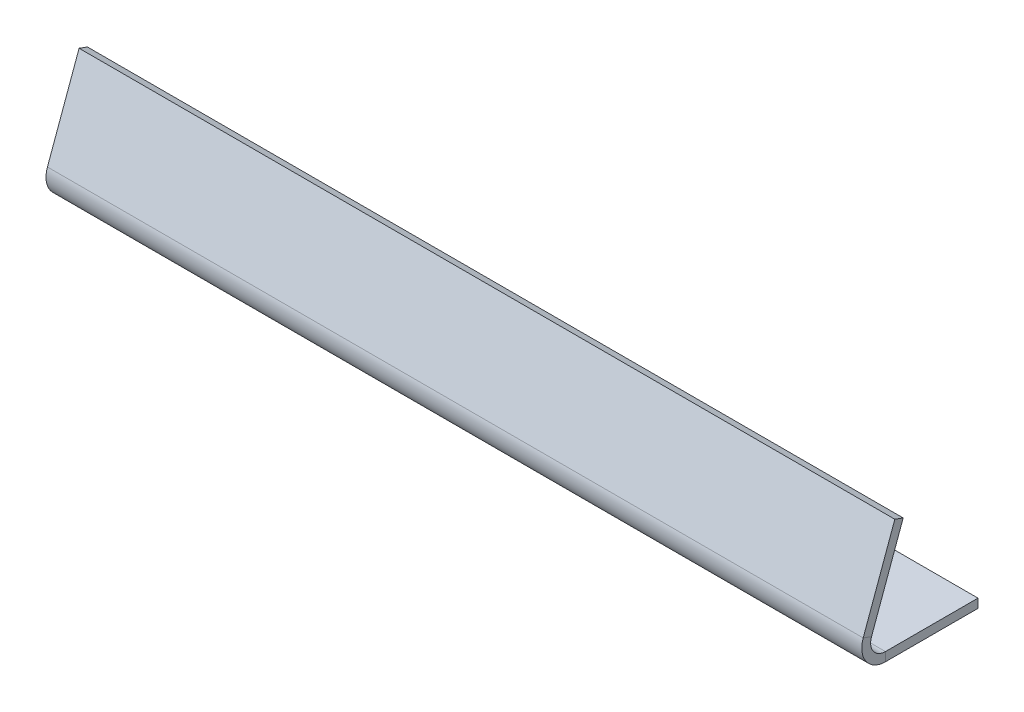
ISO-10303-21;
HEADER;
FILE_DESCRIPTION(('STEP AP214'),'2;1');
FILE_NAME('part.step','',(''),(''),'','','');
FILE_SCHEMA(('AUTOMOTIVE_DESIGN { 1 0 10303 214 1 1 1 1 }'));
ENDSEC;
DATA;
#1=APPLICATION_CONTEXT('core data for automotive mechanical design processes');
#2=APPLICATION_PROTOCOL_DEFINITION('international standard','automotive_design',2000,#1);
#3=PRODUCT_CONTEXT('',#1,'mechanical');
#4=PRODUCT('Part','Part','',(#3));
#5=PRODUCT_RELATED_PRODUCT_CATEGORY('part','',(#4));
#6=PRODUCT_DEFINITION_FORMATION('','',#4);
#7=PRODUCT_DEFINITION_CONTEXT('part definition',#1,'design');
#8=PRODUCT_DEFINITION('design','',#6,#7);
#9=PRODUCT_DEFINITION_SHAPE('','',#8);
#10=(LENGTH_UNIT() NAMED_UNIT(*) SI_UNIT(.MILLI.,.METRE.));
#11=(NAMED_UNIT(*) PLANE_ANGLE_UNIT() SI_UNIT($,.RADIAN.));
#12=(NAMED_UNIT(*) SI_UNIT($,.STERADIAN.) SOLID_ANGLE_UNIT());
#13=UNCERTAINTY_MEASURE_WITH_UNIT(LENGTH_MEASURE(1.E-05),#10,'distance_accuracy_value','');
#14=(GEOMETRIC_REPRESENTATION_CONTEXT(3) GLOBAL_UNCERTAINTY_ASSIGNED_CONTEXT((#13)) GLOBAL_UNIT_ASSIGNED_CONTEXT((#10,
#11,#12)) REPRESENTATION_CONTEXT('',''));
#15=CARTESIAN_POINT('',(0.,0.,0.));
#16=DIRECTION('',(0.,0.,1.));
#17=DIRECTION('',(1.,0.,0.));
#18=AXIS2_PLACEMENT_3D('',#15,#16,#17);
#19=CARTESIAN_POINT('',(27.55,7.42227467667266,-1.88274279780496));
#20=DIRECTION('',(1.,0.,0.));
#21=DIRECTION('',(0.,-0.939692620785907,0.342020143325673));
#22=AXIS2_PLACEMENT_3D('',#19,#20,#21);
#23=PLANE('',#22);
#24=DIRECTION('',(0.,-0.939692620785907,0.342020143325673));
#25=VECTOR('',#24,1.);
#26=CARTESIAN_POINT('',(27.55,7.42227467667266,-1.88274279780496));
#27=LINE('',#26,#25);
#28=CARTESIAN_POINT('',(27.55,7.42227467667266,-1.88274279780496));
#29=VERTEX_POINT('',#28);
#30=CARTESIAN_POINT('',(27.55,1.54723222932108,0.255597778081503));
#31=VERTEX_POINT('',#30);
#32=EDGE_CURVE('E99',#29,#31,#27,.T.);
#33=ORIENTED_EDGE('',*,*,#32,.T.);
#34=DIRECTION('',(0.,-0.342020143325673,-0.939692620785907));
#35=VECTOR('',#34,1.);
#36=CARTESIAN_POINT('',(27.55,1.54723222932108,0.255597778081503));
#37=LINE('',#36,#35);
#38=CARTESIAN_POINT('',(27.55,1.34202014332567,-0.308217794390042));
#39=VERTEX_POINT('',#38);
#40=EDGE_CURVE('E12',#31,#39,#37,.T.);
#41=ORIENTED_EDGE('',*,*,#40,.T.);
#42=DIRECTION('',(0.,-0.939692620785907,0.342020143325673));
#43=VECTOR('',#42,1.);
#44=CARTESIAN_POINT('',(27.55,7.21706259067726,-2.44655837027651));
#45=LINE('',#44,#43);
#46=CARTESIAN_POINT('',(27.55,7.21706259067726,-2.44655837027651));
#47=VERTEX_POINT('',#46);
#48=EDGE_CURVE('E89',#47,#39,#45,.T.);
#49=ORIENTED_EDGE('',*,*,#48,.F.);
#50=DIRECTION('',(0.,-0.342020143325673,-0.939692620785907));
#51=VECTOR('',#50,1.);
#52=CARTESIAN_POINT('',(27.55,7.42227467667266,-1.88274279780496));
#53=LINE('',#52,#51);
#54=EDGE_CURVE('E66',#29,#47,#53,.T.);
#55=ORIENTED_EDGE('',*,*,#54,.F.);
#56=EDGE_LOOP('',(#33,#41,#49,#55));
#57=FACE_BOUND('',#56,.T.);
#58=ADVANCED_FACE('F41',(#57),#23,.T.);
#59=CARTESIAN_POINT('',(-27.55,7.42227467667266,-1.88274279780496));
#60=DIRECTION('',(-1.,0.,0.));
#61=DIRECTION('',(0.,0.939692620785907,-0.342020143325673));
#62=AXIS2_PLACEMENT_3D('',#59,#60,#61);
#63=PLANE('',#62);
#64=DIRECTION('',(0.,0.939692620785907,-0.342020143325673));
#65=VECTOR('',#64,1.);
#66=CARTESIAN_POINT('',(-27.55,7.21706259067726,-2.44655837027651));
#67=LINE('',#66,#65);
#68=CARTESIAN_POINT('',(-27.55,1.34202014332567,-0.308217794390042));
#69=VERTEX_POINT('',#68);
#70=CARTESIAN_POINT('',(-27.55,7.21706259067726,-2.44655837027651));
#71=VERTEX_POINT('',#70);
#72=EDGE_CURVE('E93',#69,#71,#67,.T.);
#73=ORIENTED_EDGE('',*,*,#72,.F.);
#74=DIRECTION('',(0.,0.342020143325673,0.939692620785907));
#75=VECTOR('',#74,1.);
#76=CARTESIAN_POINT('',(-27.55,1.54723222932108,0.255597778081503));
#77=LINE('',#76,#75);
#78=CARTESIAN_POINT('',(-27.55,1.54723222932108,0.255597778081502));
#79=VERTEX_POINT('',#78);
#80=EDGE_CURVE('E108',#69,#79,#77,.T.);
#81=ORIENTED_EDGE('',*,*,#80,.T.);
#82=DIRECTION('',(0.,0.939692620785907,-0.342020143325673));
#83=VECTOR('',#82,1.);
#84=CARTESIAN_POINT('',(-27.55,7.42227467667266,-1.88274279780496));
#85=LINE('',#84,#83);
#86=CARTESIAN_POINT('',(-27.55,7.42227467667266,-1.88274279780496));
#87=VERTEX_POINT('',#86);
#88=EDGE_CURVE('E44',#79,#87,#85,.T.);
#89=ORIENTED_EDGE('',*,*,#88,.T.);
#90=DIRECTION('',(0.,-0.342020143325673,-0.939692620785907));
#91=VECTOR('',#90,1.);
#92=CARTESIAN_POINT('',(-27.55,7.42227467667266,-1.88274279780496));
#93=LINE('',#92,#91);
#94=EDGE_CURVE('E86',#87,#71,#93,.T.);
#95=ORIENTED_EDGE('',*,*,#94,.T.);
#96=EDGE_LOOP('',(#73,#81,#89,#95));
#97=FACE_BOUND('',#96,.T.);
#98=ADVANCED_FACE('F206',(#97),#63,.T.);
#99=CARTESIAN_POINT('',(0.,0.37458002077836,0.682408277137581));
#100=DIRECTION('',(0.,0.342020143325673,0.939692620785907));
#101=DIRECTION('',(0.,-0.939692620785907,0.342020143325673));
#102=AXIS2_PLACEMENT_3D('',#99,#100,#101);
#103=PLANE('',#102);
#104=ORIENTED_EDGE('',*,*,#88,.F.);
#105=DIRECTION('',(1.,0.,0.));
#106=VECTOR('',#105,1.);
#107=CARTESIAN_POINT('',(0.,1.54723222932108,0.255597778081503));
#108=LINE('',#107,#106);
#109=EDGE_CURVE('E85',#79,#31,#108,.T.);
#110=ORIENTED_EDGE('',*,*,#109,.T.);
#111=ORIENTED_EDGE('',*,*,#32,.F.);
#112=DIRECTION('',(1.,0.,0.));
#113=VECTOR('',#112,1.);
#114=CARTESIAN_POINT('',(-27.55,7.42227467667266,-1.88274279780496));
#115=LINE('',#114,#113);
#116=EDGE_CURVE('E84',#87,#29,#115,.T.);
#117=ORIENTED_EDGE('',*,*,#116,.F.);
#118=EDGE_LOOP('',(#104,#110,#111,#117));
#119=FACE_BOUND('',#118,.T.);
#120=ADVANCED_FACE('F204',(#119),#103,.T.);
#121=CARTESIAN_POINT('',(-27.55,7.42227467667266,-1.88274279780496));
#122=DIRECTION('',(0.,0.939692620785907,-0.342020143325673));
#123=DIRECTION('',(1.,0.,0.));
#124=AXIS2_PLACEMENT_3D('',#121,#122,#123);
#125=PLANE('',#124);
#126=DIRECTION('',(1.,0.,0.));
#127=VECTOR('',#126,1.);
#128=CARTESIAN_POINT('',(-27.55,7.21706259067726,-2.44655837027651));
#129=LINE('',#128,#127);
#130=EDGE_CURVE('E82',#71,#47,#129,.T.);
#131=ORIENTED_EDGE('',*,*,#130,.F.);
#132=ORIENTED_EDGE('',*,*,#94,.F.);
#133=ORIENTED_EDGE('',*,*,#116,.T.);
#134=ORIENTED_EDGE('',*,*,#54,.T.);
#135=EDGE_LOOP('',(#131,#132,#133,#134));
#136=FACE_BOUND('',#135,.T.);
#137=ADVANCED_FACE('F79',(#136),#125,.T.);
#138=CARTESIAN_POINT('',(0.,0.169367934782956,0.118592704666037));
#139=DIRECTION('',(0.,0.342020143325673,0.939692620785907));
#140=DIRECTION('',(0.,-0.939692620785907,0.342020143325673));
#141=AXIS2_PLACEMENT_3D('',#138,#139,#140);
#142=PLANE('',#141);
#143=DIRECTION('',(1.,0.,0.));
#144=VECTOR('',#143,1.);
#145=CARTESIAN_POINT('',(0.,1.34202014332567,-0.308217794390041));
#146=LINE('',#145,#144);
#147=EDGE_CURVE('E49',#69,#39,#146,.T.);
#148=ORIENTED_EDGE('',*,*,#147,.F.);
#149=ORIENTED_EDGE('',*,*,#72,.T.);
#150=ORIENTED_EDGE('',*,*,#130,.T.);
#151=ORIENTED_EDGE('',*,*,#48,.T.);
#152=EDGE_LOOP('',(#148,#149,#150,#151));
#153=FACE_BOUND('',#152,.T.);
#154=ADVANCED_FACE('F96',(#153),#142,.F.);
#155=CARTESIAN_POINT('',(-27.55,-0.6,-7.5));
#156=DIRECTION('',(0.,0.,-1.));
#157=DIRECTION('',(-1.,0.,0.));
#158=AXIS2_PLACEMENT_3D('',#155,#156,#157);
#159=PLANE('',#158);
#160=DIRECTION('',(-1.,0.,0.));
#161=VECTOR('',#160,1.);
#162=CARTESIAN_POINT('',(-27.55,0.,-7.5));
#163=LINE('',#162,#161);
#164=CARTESIAN_POINT('',(27.55,0.,-7.5));
#165=VERTEX_POINT('',#164);
#166=CARTESIAN_POINT('',(-27.55,0.,-7.5));
#167=VERTEX_POINT('',#166);
#168=EDGE_CURVE('E141',#165,#167,#163,.T.);
#169=ORIENTED_EDGE('',*,*,#168,.F.);
#170=DIRECTION('',(0.,1.,0.));
#171=VECTOR('',#170,1.);
#172=CARTESIAN_POINT('',(27.55,-0.6,-7.5));
#173=LINE('',#172,#171);
#174=CARTESIAN_POINT('',(27.55,-0.6,-7.5));
#175=VERTEX_POINT('',#174);
#176=EDGE_CURVE('E94',#175,#165,#173,.T.);
#177=ORIENTED_EDGE('',*,*,#176,.F.);
#178=DIRECTION('',(-1.,0.,0.));
#179=VECTOR('',#178,1.);
#180=CARTESIAN_POINT('',(-27.55,-0.6,-7.5));
#181=LINE('',#180,#179);
#182=CARTESIAN_POINT('',(-27.55,-0.6,-7.5));
#183=VERTEX_POINT('',#182);
#184=EDGE_CURVE('E159',#175,#183,#181,.T.);
#185=ORIENTED_EDGE('',*,*,#184,.T.);
#186=DIRECTION('',(0.,1.,0.));
#187=VECTOR('',#186,1.);
#188=CARTESIAN_POINT('',(-27.55,-0.6,-7.5));
#189=LINE('',#188,#187);
#190=EDGE_CURVE('E156',#183,#167,#189,.T.);
#191=ORIENTED_EDGE('',*,*,#190,.T.);
#192=EDGE_LOOP('',(#169,#177,#185,#191));
#193=FACE_BOUND('',#192,.T.);
#194=ADVANCED_FACE('F216',(#193),#159,.T.);
#195=CARTESIAN_POINT('',(0.,-0.6,0.));
#196=DIRECTION('',(0.,-1.,0.));
#197=DIRECTION('',(0.,0.,-1.));
#198=AXIS2_PLACEMENT_3D('',#195,#196,#197);
#199=PLANE('',#198);
#200=DIRECTION('',(1.,0.,0.));
#201=VECTOR('',#200,1.);
#202=CARTESIAN_POINT('',(0.,-0.6,-1.24791041517595));
#203=LINE('',#202,#201);
#204=CARTESIAN_POINT('',(-27.55,-0.6,-1.24791041517595));
#205=VERTEX_POINT('',#204);
#206=CARTESIAN_POINT('',(27.55,-0.6,-1.24791041517595));
#207=VERTEX_POINT('',#206);
#208=EDGE_CURVE('E165',#205,#207,#203,.T.);
#209=ORIENTED_EDGE('',*,*,#208,.F.);
#210=DIRECTION('',(0.,0.,1.));
#211=VECTOR('',#210,1.);
#212=CARTESIAN_POINT('',(-27.55,-0.6,7.5));
#213=LINE('',#212,#211);
#214=EDGE_CURVE('E153',#183,#205,#213,.T.);
#215=ORIENTED_EDGE('',*,*,#214,.F.);
#216=ORIENTED_EDGE('',*,*,#184,.F.);
#217=DIRECTION('',(0.,0.,-1.));
#218=VECTOR('',#217,1.);
#219=CARTESIAN_POINT('',(27.55,-0.6,7.5));
#220=LINE('',#219,#218);
#221=EDGE_CURVE('E138',#207,#175,#220,.T.);
#222=ORIENTED_EDGE('',*,*,#221,.F.);
#223=EDGE_LOOP('',(#209,#215,#216,#222));
#224=FACE_BOUND('',#223,.T.);
#225=ADVANCED_FACE('F174',(#224),#199,.T.);
#226=CARTESIAN_POINT('',(-27.55,-0.6,7.5));
#227=DIRECTION('',(-1.,0.,0.));
#228=DIRECTION('',(0.,0.,1.));
#229=AXIS2_PLACEMENT_3D('',#226,#227,#228);
#230=PLANE('',#229);
#231=DIRECTION('',(0.,-1.,0.));
#232=VECTOR('',#231,1.);
#233=CARTESIAN_POINT('',(-27.55,-0.600000000000001,-1.24791041517595));
#234=LINE('',#233,#232);
#235=CARTESIAN_POINT('',(-27.55,0.,-1.24791041517595));
#236=VERTEX_POINT('',#235);
#237=EDGE_CURVE('E162',#236,#205,#234,.T.);
#238=ORIENTED_EDGE('',*,*,#237,.F.);
#239=DIRECTION('',(0.,0.,1.));
#240=VECTOR('',#239,1.);
#241=CARTESIAN_POINT('',(-27.55,0.,7.5));
#242=LINE('',#241,#240);
#243=EDGE_CURVE('E150',#167,#236,#242,.T.);
#244=ORIENTED_EDGE('',*,*,#243,.F.);
#245=ORIENTED_EDGE('',*,*,#190,.F.);
#246=ORIENTED_EDGE('',*,*,#214,.T.);
#247=EDGE_LOOP('',(#238,#244,#245,#246));
#248=FACE_BOUND('',#247,.T.);
#249=ADVANCED_FACE('F187',(#248),#230,.T.);
#250=CARTESIAN_POINT('',(0.,0.,0.));
#251=DIRECTION('',(0.,-1.,0.));
#252=DIRECTION('',(0.,0.,-1.));
#253=AXIS2_PLACEMENT_3D('',#250,#251,#252);
#254=PLANE('',#253);
#255=ORIENTED_EDGE('',*,*,#243,.T.);
#256=DIRECTION('',(1.,0.,0.));
#257=VECTOR('',#256,1.);
#258=CARTESIAN_POINT('',(0.,0.,-1.24791041517595));
#259=LINE('',#258,#257);
#260=CARTESIAN_POINT('',(27.55,0.,-1.24791041517595));
#261=VERTEX_POINT('',#260);
#262=EDGE_CURVE('E147',#236,#261,#259,.T.);
#263=ORIENTED_EDGE('',*,*,#262,.T.);
#264=DIRECTION('',(0.,0.,-1.));
#265=VECTOR('',#264,1.);
#266=CARTESIAN_POINT('',(27.55,0.,7.5));
#267=LINE('',#266,#265);
#268=EDGE_CURVE('E144',#261,#165,#267,.T.);
#269=ORIENTED_EDGE('',*,*,#268,.T.);
#270=ORIENTED_EDGE('',*,*,#168,.T.);
#271=EDGE_LOOP('',(#255,#263,#269,#270));
#272=FACE_BOUND('',#271,.T.);
#273=ADVANCED_FACE('F192',(#272),#254,.F.);
#274=CARTESIAN_POINT('',(27.55,-0.6,7.5));
#275=DIRECTION('',(1.,0.,0.));
#276=DIRECTION('',(0.,0.,-1.));
#277=AXIS2_PLACEMENT_3D('',#274,#275,#276);
#278=PLANE('',#277);
#279=DIRECTION('',(0.,1.,0.));
#280=VECTOR('',#279,1.);
#281=CARTESIAN_POINT('',(27.55,-0.600000000000001,-1.24791041517595));
#282=LINE('',#281,#280);
#283=EDGE_CURVE('E128',#207,#261,#282,.T.);
#284=ORIENTED_EDGE('',*,*,#283,.F.);
#285=ORIENTED_EDGE('',*,*,#221,.T.);
#286=ORIENTED_EDGE('',*,*,#176,.T.);
#287=ORIENTED_EDGE('',*,*,#268,.F.);
#288=EDGE_LOOP('',(#284,#285,#286,#287));
#289=FACE_BOUND('',#288,.T.);
#290=ADVANCED_FACE('F226',(#289),#278,.T.);
#291=CARTESIAN_POINT('',(-27.55,1.,-1.24791041517595));
#292=DIRECTION('',(-1.,0.,0.));
#293=DIRECTION('',(0.,0.,1.));
#294=AXIS2_PLACEMENT_3D('',#291,#292,#293);
#295=PLANE('',#294);
#296=ORIENTED_EDGE('',*,*,#80,.F.);
#297=CARTESIAN_POINT('',(-27.55,1.,-1.24791041517595));
#298=DIRECTION('',(-1.,0.,0.));
#299=DIRECTION('',(0.,0.,1.));
#300=AXIS2_PLACEMENT_3D('',#297,#298,#299);
#301=CIRCLE('',#300,1.);
#302=EDGE_CURVE('E122',#69,#236,#301,.F.);
#303=ORIENTED_EDGE('',*,*,#302,.T.);
#304=ORIENTED_EDGE('',*,*,#237,.T.);
#305=CARTESIAN_POINT('',(-27.55,1.,-1.24791041517595));
#306=DIRECTION('',(1.,0.,0.));
#307=DIRECTION('',(0.,0.,1.));
#308=AXIS2_PLACEMENT_3D('',#305,#306,#307);
#309=CIRCLE('',#308,1.6);
#310=EDGE_CURVE('E129',#79,#205,#309,.T.);
#311=ORIENTED_EDGE('',*,*,#310,.F.);
#312=EDGE_LOOP('',(#296,#303,#304,#311));
#313=FACE_BOUND('',#312,.T.);
#314=ADVANCED_FACE('F182',(#313),#295,.T.);
#315=CARTESIAN_POINT('',(27.55,1.,-1.24791041517595));
#316=DIRECTION('',(1.,0.,0.));
#317=DIRECTION('',(0.,0.,-1.));
#318=AXIS2_PLACEMENT_3D('',#315,#316,#317);
#319=PLANE('',#318);
#320=CARTESIAN_POINT('',(27.55,1.,-1.24791041517595));
#321=DIRECTION('',(-1.,0.,0.));
#322=DIRECTION('',(0.,0.,1.));
#323=AXIS2_PLACEMENT_3D('',#320,#321,#322);
#324=CIRCLE('',#323,1.);
#325=EDGE_CURVE('E119',#261,#39,#324,.T.);
#326=ORIENTED_EDGE('',*,*,#325,.T.);
#327=ORIENTED_EDGE('',*,*,#40,.F.);
#328=CARTESIAN_POINT('',(27.55,1.,-1.24791041517595));
#329=DIRECTION('',(-1.,0.,0.));
#330=DIRECTION('',(0.,0.,-1.));
#331=AXIS2_PLACEMENT_3D('',#328,#329,#330);
#332=CIRCLE('',#331,1.6);
#333=EDGE_CURVE('E57',#207,#31,#332,.T.);
#334=ORIENTED_EDGE('',*,*,#333,.F.);
#335=ORIENTED_EDGE('',*,*,#283,.T.);
#336=EDGE_LOOP('',(#326,#327,#334,#335));
#337=FACE_BOUND('',#336,.T.);
#338=ADVANCED_FACE('F126',(#337),#319,.T.);
#339=CARTESIAN_POINT('',(55.1597599851306,1.,-1.24791041517595));
#340=DIRECTION('',(-1.,0.,0.));
#341=DIRECTION('',(0.,0.,1.));
#342=AXIS2_PLACEMENT_3D('',#339,#340,#341);
#343=CYLINDRICAL_SURFACE('',#342,1.6);
#344=ORIENTED_EDGE('',*,*,#208,.T.);
#345=ORIENTED_EDGE('',*,*,#333,.T.);
#346=ORIENTED_EDGE('',*,*,#109,.F.);
#347=ORIENTED_EDGE('',*,*,#310,.T.);
#348=EDGE_LOOP('',(#344,#345,#346,#347));
#349=FACE_BOUND('',#348,.T.);
#350=ADVANCED_FACE('F168',(#349),#343,.T.);
#351=CARTESIAN_POINT('',(55.1597599851306,1.,-1.24791041517595));
#352=DIRECTION('',(-1.,0.,0.));
#353=DIRECTION('',(0.,0.,1.));
#354=AXIS2_PLACEMENT_3D('',#351,#352,#353);
#355=CYLINDRICAL_SURFACE('',#354,1.);
#356=ORIENTED_EDGE('',*,*,#262,.F.);
#357=ORIENTED_EDGE('',*,*,#302,.F.);
#358=ORIENTED_EDGE('',*,*,#147,.T.);
#359=ORIENTED_EDGE('',*,*,#325,.F.);
#360=EDGE_LOOP('',(#356,#357,#358,#359));
#361=FACE_BOUND('',#360,.T.);
#362=ADVANCED_FACE('F117',(#361),#355,.F.);
#363=CLOSED_SHELL('',(#58,#98,#120,#137,#154,#194,#225,#249,#273,#290,#314,#338,#350,#362));
#364=MANIFOLD_SOLID_BREP('B2',#363);
#365=ADVANCED_BREP_SHAPE_REPRESENTATION('',(#18,#364),#14);
#366=SHAPE_DEFINITION_REPRESENTATION(#9,#365);
ENDSEC;
END-ISO-10303-21;
